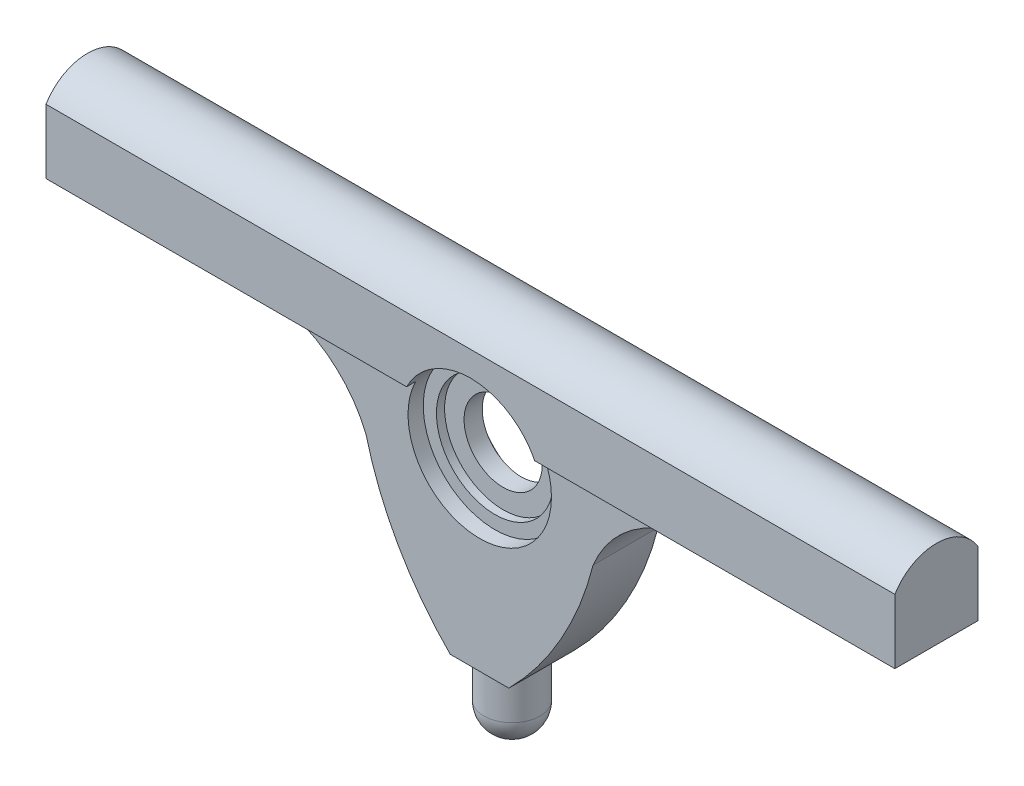
ISO-10303-21;
HEADER;
FILE_DESCRIPTION(('STEP AP214'),'2;1');
FILE_NAME('part.step','',(''),(''),'','','');
FILE_SCHEMA(('AUTOMOTIVE_DESIGN { 1 0 10303 214 1 1 1 1 }'));
ENDSEC;
DATA;
#1=APPLICATION_CONTEXT('core data for automotive mechanical design processes');
#2=APPLICATION_PROTOCOL_DEFINITION('international standard','automotive_design',2000,#1);
#3=PRODUCT_CONTEXT('',#1,'mechanical');
#4=PRODUCT('Part','Part','',(#3));
#5=PRODUCT_RELATED_PRODUCT_CATEGORY('part','',(#4));
#6=PRODUCT_DEFINITION_FORMATION('','',#4);
#7=PRODUCT_DEFINITION_CONTEXT('part definition',#1,'design');
#8=PRODUCT_DEFINITION('design','',#6,#7);
#9=PRODUCT_DEFINITION_SHAPE('','',#8);
#10=(LENGTH_UNIT() NAMED_UNIT(*) SI_UNIT(.MILLI.,.METRE.));
#11=(NAMED_UNIT(*) PLANE_ANGLE_UNIT() SI_UNIT($,.RADIAN.));
#12=(NAMED_UNIT(*) SI_UNIT($,.STERADIAN.) SOLID_ANGLE_UNIT());
#13=UNCERTAINTY_MEASURE_WITH_UNIT(LENGTH_MEASURE(1.E-05),#10,'distance_accuracy_value','');
#14=(GEOMETRIC_REPRESENTATION_CONTEXT(3) GLOBAL_UNCERTAINTY_ASSIGNED_CONTEXT((#13)) GLOBAL_UNIT_ASSIGNED_CONTEXT((#10,
#11,#12)) REPRESENTATION_CONTEXT('',''));
#15=CARTESIAN_POINT('',(0.,0.,0.));
#16=DIRECTION('',(0.,0.,1.));
#17=DIRECTION('',(1.,0.,0.));
#18=AXIS2_PLACEMENT_3D('',#15,#16,#17);
#19=CARTESIAN_POINT('',(92.075,-6.985,9.017));
#20=DIRECTION('',(0.,1.,0.));
#21=DIRECTION('',(0.,0.,1.));
#22=AXIS2_PLACEMENT_3D('',#19,#20,#21);
#23=PLANE('',#22);
#24=DIRECTION('',(0.,0.,1.));
#25=VECTOR('',#24,1.);
#26=CARTESIAN_POINT('',(-13.8470055256227,-6.985,55.7699492853136));
#27=LINE('',#26,#25);
#28=CARTESIAN_POINT('',(-13.8470055256227,-6.985,9.017));
#29=VERTEX_POINT('',#28);
#30=CARTESIAN_POINT('',(-13.8470055256227,-6.985,7.04850000000001));
#31=VERTEX_POINT('',#30);
#32=EDGE_CURVE('E49',#29,#31,#27,.F.);
#33=ORIENTED_EDGE('',*,*,#32,.F.);
#34=DIRECTION('',(-1.,0.,0.));
#35=VECTOR('',#34,1.);
#36=CARTESIAN_POINT('',(92.075,-6.985,9.017));
#37=LINE('',#36,#35);
#38=CARTESIAN_POINT('',(-92.075,-6.985,9.017));
#39=VERTEX_POINT('',#38);
#40=EDGE_CURVE('E156',#29,#39,#37,.T.);
#41=ORIENTED_EDGE('',*,*,#40,.T.);
#42=DIRECTION('',(0.,0.,-1.));
#43=VECTOR('',#42,1.);
#44=CARTESIAN_POINT('',(-92.075,-6.985,9.017));
#45=LINE('',#44,#43);
#46=CARTESIAN_POINT('',(-92.075,-6.985,-9.017));
#47=VERTEX_POINT('',#46);
#48=EDGE_CURVE('E347',#39,#47,#45,.T.);
#49=ORIENTED_EDGE('',*,*,#48,.T.);
#50=DIRECTION('',(-1.,0.,0.));
#51=VECTOR('',#50,1.);
#52=CARTESIAN_POINT('',(92.075,-6.985,-9.017));
#53=LINE('',#52,#51);
#54=CARTESIAN_POINT('',(-13.8470055256227,-6.985,-9.017));
#55=VERTEX_POINT('',#54);
#56=EDGE_CURVE('E157',#55,#47,#53,.T.);
#57=ORIENTED_EDGE('',*,*,#56,.F.);
#58=DIRECTION('',(0.,0.,1.));
#59=VECTOR('',#58,1.);
#60=CARTESIAN_POINT('',(-13.8470055256227,-6.985,55.7699492853136));
#61=LINE('',#60,#59);
#62=CARTESIAN_POINT('',(-13.8470055256227,-6.985,-7.04849999999999));
#63=VERTEX_POINT('',#62);
#64=EDGE_CURVE('E135',#63,#55,#61,.F.);
#65=ORIENTED_EDGE('',*,*,#64,.F.);
#66=DIRECTION('',(-1.,0.,0.));
#67=VECTOR('',#66,1.);
#68=CARTESIAN_POINT('',(-43.18,-6.985,-7.0485));
#69=LINE('',#68,#67);
#70=CARTESIAN_POINT('',(-43.18,-6.985,-7.0485));
#71=VERTEX_POINT('',#70);
#72=EDGE_CURVE('E169',#63,#71,#69,.T.);
#73=ORIENTED_EDGE('',*,*,#72,.T.);
#74=DIRECTION('',(0.,0.,1.));
#75=VECTOR('',#74,1.);
#76=CARTESIAN_POINT('',(-43.18,-6.985,-7.0485));
#77=LINE('',#76,#75);
#78=CARTESIAN_POINT('',(-43.18,-6.985,7.0485));
#79=VERTEX_POINT('',#78);
#80=EDGE_CURVE('E184',#71,#79,#77,.T.);
#81=ORIENTED_EDGE('',*,*,#80,.T.);
#82=DIRECTION('',(-1.,0.,0.));
#83=VECTOR('',#82,1.);
#84=CARTESIAN_POINT('',(-43.18,-6.985,7.0485));
#85=LINE('',#84,#83);
#86=EDGE_CURVE('E181',#31,#79,#85,.T.);
#87=ORIENTED_EDGE('',*,*,#86,.F.);
#88=EDGE_LOOP('',(#33,#41,#49,#57,#65,#73,#81,#87));
#89=FACE_BOUND('',#88,.T.);
#90=ADVANCED_FACE('F34',(#89),#23,.F.);
#91=DIRECTION('',(0.,0.,1.));
#92=VECTOR('',#91,1.);
#93=CARTESIAN_POINT('',(13.9482534524388,-6.985,55.7699492853136));
#94=LINE('',#93,#92);
#95=CARTESIAN_POINT('',(13.9482534524388,-6.985,7.04850000000001));
#96=VERTEX_POINT('',#95);
#97=CARTESIAN_POINT('',(13.9482534524388,-6.985,9.017));
#98=VERTEX_POINT('',#97);
#99=EDGE_CURVE('E270',#96,#98,#94,.T.);
#100=ORIENTED_EDGE('',*,*,#99,.F.);
#101=CARTESIAN_POINT('',(43.18,-6.985,7.0485));
#102=VERTEX_POINT('',#101);
#103=EDGE_CURVE('E177',#102,#96,#85,.T.);
#104=ORIENTED_EDGE('',*,*,#103,.F.);
#105=DIRECTION('',(0.,0.,1.));
#106=VECTOR('',#105,1.);
#107=CARTESIAN_POINT('',(43.18,-6.985,-7.0485));
#108=LINE('',#107,#106);
#109=CARTESIAN_POINT('',(43.18,-6.985,-7.0485));
#110=VERTEX_POINT('',#109);
#111=EDGE_CURVE('E172',#110,#102,#108,.T.);
#112=ORIENTED_EDGE('',*,*,#111,.F.);
#113=CARTESIAN_POINT('',(13.9482534524388,-6.985,-7.04849999999999));
#114=VERTEX_POINT('',#113);
#115=EDGE_CURVE('E150',#110,#114,#69,.T.);
#116=ORIENTED_EDGE('',*,*,#115,.T.);
#117=DIRECTION('',(0.,0.,1.));
#118=VECTOR('',#117,1.);
#119=CARTESIAN_POINT('',(13.9482534524388,-6.985,55.7699492853136));
#120=LINE('',#119,#118);
#121=CARTESIAN_POINT('',(13.9482534524388,-6.985,-9.017));
#122=VERTEX_POINT('',#121);
#123=EDGE_CURVE('E56',#122,#114,#120,.T.);
#124=ORIENTED_EDGE('',*,*,#123,.F.);
#125=CARTESIAN_POINT('',(92.075,-6.985,-9.017));
#126=VERTEX_POINT('',#125);
#127=EDGE_CURVE('E147',#126,#122,#53,.T.);
#128=ORIENTED_EDGE('',*,*,#127,.F.);
#129=DIRECTION('',(0.,0.,-1.));
#130=VECTOR('',#129,1.);
#131=CARTESIAN_POINT('',(92.075,-6.985,9.017));
#132=LINE('',#131,#130);
#133=CARTESIAN_POINT('',(92.075,-6.985,9.017));
#134=VERTEX_POINT('',#133);
#135=EDGE_CURVE('E334',#134,#126,#132,.T.);
#136=ORIENTED_EDGE('',*,*,#135,.F.);
#137=EDGE_CURVE('E159',#134,#98,#37,.T.);
#138=ORIENTED_EDGE('',*,*,#137,.T.);
#139=EDGE_LOOP('',(#100,#104,#112,#116,#124,#128,#136,#138));
#140=FACE_BOUND('',#139,.T.);
#141=ADVANCED_FACE('F145',(#140),#23,.F.);
#142=CARTESIAN_POINT('',(92.075,1.5224125,0.));
#143=DIRECTION('',(-1.,0.,0.));
#144=DIRECTION('',(0.,0.,1.));
#145=AXIS2_PLACEMENT_3D('',#142,#143,#144);
#146=CYLINDRICAL_SURFACE('',#145,10.5425875);
#147=CARTESIAN_POINT('',(-92.075,1.5224125,0.));
#148=DIRECTION('',(1.,0.,0.));
#149=DIRECTION('',(0.,0.,1.));
#150=AXIS2_PLACEMENT_3D('',#147,#148,#149);
#151=CIRCLE('',#150,10.5425875);
#152=CARTESIAN_POINT('',(-92.075,6.985,-9.017));
#153=VERTEX_POINT('',#152);
#154=CARTESIAN_POINT('',(-92.075,6.985,9.017));
#155=VERTEX_POINT('',#154);
#156=EDGE_CURVE('E210',#153,#155,#151,.T.);
#157=ORIENTED_EDGE('',*,*,#156,.T.);
#158=DIRECTION('',(-1.,0.,0.));
#159=VECTOR('',#158,1.);
#160=CARTESIAN_POINT('',(92.075,6.985,9.017));
#161=LINE('',#160,#159);
#162=CARTESIAN_POINT('',(92.075,6.985,9.017));
#163=VERTEX_POINT('',#162);
#164=EDGE_CURVE('E166',#163,#155,#161,.T.);
#165=ORIENTED_EDGE('',*,*,#164,.F.);
#166=CARTESIAN_POINT('',(92.075,1.5224125,0.));
#167=DIRECTION('',(1.,0.,0.));
#168=DIRECTION('',(0.,0.,1.));
#169=AXIS2_PLACEMENT_3D('',#166,#167,#168);
#170=CIRCLE('',#169,10.5425875);
#171=CARTESIAN_POINT('',(92.075,6.985,-9.017));
#172=VERTEX_POINT('',#171);
#173=EDGE_CURVE('E339',#172,#163,#170,.T.);
#174=ORIENTED_EDGE('',*,*,#173,.F.);
#175=DIRECTION('',(-1.,0.,0.));
#176=VECTOR('',#175,1.);
#177=CARTESIAN_POINT('',(92.075,6.985,-9.017));
#178=LINE('',#177,#176);
#179=EDGE_CURVE('E161',#172,#153,#178,.T.);
#180=ORIENTED_EDGE('',*,*,#179,.T.);
#181=EDGE_LOOP('',(#157,#165,#174,#180));
#182=FACE_BOUND('',#181,.T.);
#183=ADVANCED_FACE('F36',(#182),#146,.T.);
#184=CARTESIAN_POINT('',(92.075,-6.985,9.017));
#185=DIRECTION('',(0.,0.,-1.));
#186=DIRECTION('',(-1.,0.,0.));
#187=AXIS2_PLACEMENT_3D('',#184,#185,#186);
#188=PLANE('',#187);
#189=CARTESIAN_POINT('',(0.0506239634080682,-13.9772600663607,9.017));
#190=DIRECTION('',(0.,0.,1.));
#191=DIRECTION('',(1.,0.,0.));
#192=AXIS2_PLACEMENT_3D('',#189,#190,#191);
#193=CIRCLE('',#192,15.5575);
#194=EDGE_CURVE('E151',#98,#29,#193,.T.);
#195=ORIENTED_EDGE('',*,*,#194,.F.);
#196=ORIENTED_EDGE('',*,*,#137,.F.);
#197=DIRECTION('',(0.,-1.,0.));
#198=VECTOR('',#197,1.);
#199=CARTESIAN_POINT('',(92.075,-6.985,9.017));
#200=LINE('',#199,#198);
#201=EDGE_CURVE('E336',#163,#134,#200,.T.);
#202=ORIENTED_EDGE('',*,*,#201,.F.);
#203=ORIENTED_EDGE('',*,*,#164,.T.);
#204=DIRECTION('',(0.,-1.,0.));
#205=VECTOR('',#204,1.);
#206=CARTESIAN_POINT('',(-92.075,-6.985,9.017));
#207=LINE('',#206,#205);
#208=EDGE_CURVE('E345',#155,#39,#207,.T.);
#209=ORIENTED_EDGE('',*,*,#208,.T.);
#210=ORIENTED_EDGE('',*,*,#40,.F.);
#211=EDGE_LOOP('',(#195,#196,#202,#203,#209,#210));
#212=FACE_BOUND('',#211,.T.);
#213=ADVANCED_FACE('F320',(#212),#188,.F.);
#214=CARTESIAN_POINT('',(92.075,-6.985,-9.017));
#215=DIRECTION('',(0.,0.,1.));
#216=DIRECTION('',(1.,0.,0.));
#217=AXIS2_PLACEMENT_3D('',#214,#215,#216);
#218=PLANE('',#217);
#219=CARTESIAN_POINT('',(0.0506239634080682,-13.9772600663607,-9.017));
#220=DIRECTION('',(0.,0.,1.));
#221=DIRECTION('',(1.,0.,0.));
#222=AXIS2_PLACEMENT_3D('',#219,#220,#221);
#223=CIRCLE('',#222,15.5575);
#224=EDGE_CURVE('E132',#122,#55,#223,.T.);
#225=ORIENTED_EDGE('',*,*,#224,.T.);
#226=ORIENTED_EDGE('',*,*,#56,.T.);
#227=DIRECTION('',(0.,1.,0.));
#228=VECTOR('',#227,1.);
#229=CARTESIAN_POINT('',(-92.075,-6.985,-9.017));
#230=LINE('',#229,#228);
#231=EDGE_CURVE('E348',#47,#153,#230,.T.);
#232=ORIENTED_EDGE('',*,*,#231,.T.);
#233=ORIENTED_EDGE('',*,*,#179,.F.);
#234=DIRECTION('',(0.,1.,0.));
#235=VECTOR('',#234,1.);
#236=CARTESIAN_POINT('',(92.075,-6.985,-9.017));
#237=LINE('',#236,#235);
#238=EDGE_CURVE('E155',#126,#172,#237,.T.);
#239=ORIENTED_EDGE('',*,*,#238,.F.);
#240=ORIENTED_EDGE('',*,*,#127,.T.);
#241=EDGE_LOOP('',(#225,#226,#232,#233,#239,#240));
#242=FACE_BOUND('',#241,.T.);
#243=ADVANCED_FACE('F153',(#242),#218,.F.);
#244=CARTESIAN_POINT('',(92.075,1.5224125,0.));
#245=DIRECTION('',(-1.,0.,0.));
#246=DIRECTION('',(0.,0.,1.));
#247=AXIS2_PLACEMENT_3D('',#244,#245,#246);
#248=PLANE('',#247);
#249=ORIENTED_EDGE('',*,*,#173,.T.);
#250=ORIENTED_EDGE('',*,*,#201,.T.);
#251=ORIENTED_EDGE('',*,*,#135,.T.);
#252=ORIENTED_EDGE('',*,*,#238,.T.);
#253=EDGE_LOOP('',(#249,#250,#251,#252));
#254=FACE_BOUND('',#253,.T.);
#255=ADVANCED_FACE('F327',(#254),#248,.F.);
#256=CARTESIAN_POINT('',(-92.075,1.5224125,0.));
#257=DIRECTION('',(-1.,0.,0.));
#258=DIRECTION('',(0.,0.,1.));
#259=AXIS2_PLACEMENT_3D('',#256,#257,#258);
#260=PLANE('',#259);
#261=ORIENTED_EDGE('',*,*,#156,.F.);
#262=ORIENTED_EDGE('',*,*,#231,.F.);
#263=ORIENTED_EDGE('',*,*,#48,.F.);
#264=ORIENTED_EDGE('',*,*,#208,.F.);
#265=EDGE_LOOP('',(#261,#262,#263,#264));
#266=FACE_BOUND('',#265,.T.);
#267=ADVANCED_FACE('F358',(#266),#260,.T.);
#268=CARTESIAN_POINT('',(0.,0.,7.04850000000001));
#269=DIRECTION('',(0.,0.,1.));
#270=DIRECTION('',(1.,0.,0.));
#271=AXIS2_PLACEMENT_3D('',#268,#269,#270);
#272=PLANE('',#271);
#273=ORIENTED_EDGE('',*,*,#103,.T.);
#274=CARTESIAN_POINT('',(0.0506239634080682,-13.9772600663607,7.04850000000001));
#275=DIRECTION('',(0.,0.,1.));
#276=DIRECTION('',(1.,0.,0.));
#277=AXIS2_PLACEMENT_3D('',#274,#275,#276);
#278=CIRCLE('',#277,15.5575);
#279=EDGE_CURVE('E12',#96,#31,#278,.F.);
#280=ORIENTED_EDGE('',*,*,#279,.T.);
#281=ORIENTED_EDGE('',*,*,#86,.T.);
#282=CARTESIAN_POINT('',(-48.1234864990168,-31.8992919071371,7.0485));
#283=DIRECTION('',(0.,0.,-1.));
#284=DIRECTION('',(-1.,0.,0.));
#285=AXIS2_PLACEMENT_3D('',#282,#283,#284);
#286=CIRCLE('',#285,25.4);
#287=CARTESIAN_POINT('',(-24.638,-22.225,7.0485));
#288=VERTEX_POINT('',#287);
#289=EDGE_CURVE('E225',#79,#288,#286,.T.);
#290=ORIENTED_EDGE('',*,*,#289,.T.);
#291=CARTESIAN_POINT('',(43.09050551181,-5.14073703267465,7.0485));
#292=DIRECTION('',(0.,0.,1.));
#293=DIRECTION('',(1.,0.,0.));
#294=AXIS2_PLACEMENT_3D('',#291,#292,#293);
#295=CIRCLE('',#294,69.85);
#296=CARTESIAN_POINT('',(-6.35,-54.483,7.0485));
#297=VERTEX_POINT('',#296);
#298=EDGE_CURVE('E211',#288,#297,#295,.T.);
#299=ORIENTED_EDGE('',*,*,#298,.T.);
#300=DIRECTION('',(1.,0.,0.));
#301=VECTOR('',#300,1.);
#302=CARTESIAN_POINT('',(6.35,-54.483,7.0485));
#303=LINE('',#302,#301);
#304=CARTESIAN_POINT('',(6.35,-54.483,7.0485));
#305=VERTEX_POINT('',#304);
#306=EDGE_CURVE('E218',#297,#305,#303,.T.);
#307=ORIENTED_EDGE('',*,*,#306,.T.);
#308=CARTESIAN_POINT('',(-43.09050551181,-5.14073703267465,7.0485));
#309=DIRECTION('',(0.,0.,1.));
#310=DIRECTION('',(-1.,0.,0.));
#311=AXIS2_PLACEMENT_3D('',#308,#309,#310);
#312=CIRCLE('',#311,69.85);
#313=CARTESIAN_POINT('',(24.638,-22.225,7.0485));
#314=VERTEX_POINT('',#313);
#315=EDGE_CURVE('E239',#305,#314,#312,.T.);
#316=ORIENTED_EDGE('',*,*,#315,.T.);
#317=CARTESIAN_POINT('',(48.1234864990168,-31.8992919071371,7.0485));
#318=DIRECTION('',(0.,0.,-1.));
#319=DIRECTION('',(1.,0.,0.));
#320=AXIS2_PLACEMENT_3D('',#317,#318,#319);
#321=CIRCLE('',#320,25.4);
#322=EDGE_CURVE('E253',#314,#102,#321,.T.);
#323=ORIENTED_EDGE('',*,*,#322,.T.);
#324=EDGE_LOOP('',(#273,#280,#281,#290,#299,#307,#316,#323));
#325=FACE_BOUND('',#324,.T.);
#326=ADVANCED_FACE('F271',(#325),#272,.T.);
#327=CARTESIAN_POINT('',(0.,0.,-7.04849999999999));
#328=DIRECTION('',(0.,0.,1.));
#329=DIRECTION('',(1.,0.,0.));
#330=AXIS2_PLACEMENT_3D('',#327,#328,#329);
#331=PLANE('',#330);
#332=CARTESIAN_POINT('',(0.0506239634080682,-13.9772600663607,-7.04849999999999));
#333=DIRECTION('',(0.,0.,1.));
#334=DIRECTION('',(1.,0.,0.));
#335=AXIS2_PLACEMENT_3D('',#332,#333,#334);
#336=CIRCLE('',#335,15.5575);
#337=EDGE_CURVE('E42',#114,#63,#336,.F.);
#338=ORIENTED_EDGE('',*,*,#337,.F.);
#339=ORIENTED_EDGE('',*,*,#115,.F.);
#340=CARTESIAN_POINT('',(48.1234864990168,-31.8992919071371,-7.0485));
#341=DIRECTION('',(0.,0.,-1.));
#342=DIRECTION('',(1.,0.,0.));
#343=AXIS2_PLACEMENT_3D('',#340,#341,#342);
#344=CIRCLE('',#343,25.4);
#345=CARTESIAN_POINT('',(24.638,-22.225,-7.0485));
#346=VERTEX_POINT('',#345);
#347=EDGE_CURVE('E247',#346,#110,#344,.T.);
#348=ORIENTED_EDGE('',*,*,#347,.F.);
#349=CARTESIAN_POINT('',(-43.09050551181,-5.14073703267465,-7.0485));
#350=DIRECTION('',(0.,0.,1.));
#351=DIRECTION('',(-1.,0.,0.));
#352=AXIS2_PLACEMENT_3D('',#349,#350,#351);
#353=CIRCLE('',#352,69.85);
#354=CARTESIAN_POINT('',(6.35,-54.483,-7.0485));
#355=VERTEX_POINT('',#354);
#356=EDGE_CURVE('E233',#355,#346,#353,.T.);
#357=ORIENTED_EDGE('',*,*,#356,.F.);
#358=DIRECTION('',(1.,0.,0.));
#359=VECTOR('',#358,1.);
#360=CARTESIAN_POINT('',(6.35,-54.483,-7.0485));
#361=LINE('',#360,#359);
#362=CARTESIAN_POINT('',(-6.35,-54.483,-7.0485));
#363=VERTEX_POINT('',#362);
#364=EDGE_CURVE('E217',#363,#355,#361,.T.);
#365=ORIENTED_EDGE('',*,*,#364,.F.);
#366=CARTESIAN_POINT('',(43.09050551181,-5.14073703267465,-7.0485));
#367=DIRECTION('',(0.,0.,1.));
#368=DIRECTION('',(1.,0.,0.));
#369=AXIS2_PLACEMENT_3D('',#366,#367,#368);
#370=CIRCLE('',#369,69.85);
#371=CARTESIAN_POINT('',(-24.638,-22.225,-7.0485));
#372=VERTEX_POINT('',#371);
#373=EDGE_CURVE('E207',#372,#363,#370,.T.);
#374=ORIENTED_EDGE('',*,*,#373,.F.);
#375=CARTESIAN_POINT('',(-48.1234864990168,-31.8992919071371,-7.0485));
#376=DIRECTION('',(0.,0.,-1.));
#377=DIRECTION('',(-1.,0.,0.));
#378=AXIS2_PLACEMENT_3D('',#375,#376,#377);
#379=CIRCLE('',#378,25.4);
#380=EDGE_CURVE('E192',#71,#372,#379,.T.);
#381=ORIENTED_EDGE('',*,*,#380,.F.);
#382=ORIENTED_EDGE('',*,*,#72,.F.);
#383=EDGE_LOOP('',(#338,#339,#348,#357,#365,#374,#381,#382));
#384=FACE_BOUND('',#383,.T.);
#385=ADVANCED_FACE('F278',(#384),#331,.F.);
#386=CARTESIAN_POINT('',(-48.1234864990168,-31.8992919071371,-7.0485));
#387=DIRECTION('',(0.,0.,1.));
#388=DIRECTION('',(1.,0.,0.));
#389=AXIS2_PLACEMENT_3D('',#386,#387,#388);
#390=CYLINDRICAL_SURFACE('',#389,25.4);
#391=ORIENTED_EDGE('',*,*,#289,.F.);
#392=ORIENTED_EDGE('',*,*,#80,.F.);
#393=ORIENTED_EDGE('',*,*,#380,.T.);
#394=DIRECTION('',(0.,0.,1.));
#395=VECTOR('',#394,1.);
#396=CARTESIAN_POINT('',(-24.638,-22.225,-7.0485));
#397=LINE('',#396,#395);
#398=EDGE_CURVE('E187',#372,#288,#397,.T.);
#399=ORIENTED_EDGE('',*,*,#398,.T.);
#400=EDGE_LOOP('',(#391,#392,#393,#399));
#401=FACE_BOUND('',#400,.T.);
#402=ADVANCED_FACE('F360',(#401),#390,.F.);
#403=CARTESIAN_POINT('',(48.1234864990168,-31.8992919071371,-7.0485));
#404=DIRECTION('',(0.,0.,1.));
#405=DIRECTION('',(1.,0.,0.));
#406=AXIS2_PLACEMENT_3D('',#403,#404,#405);
#407=CYLINDRICAL_SURFACE('',#406,25.4);
#408=ORIENTED_EDGE('',*,*,#322,.F.);
#409=DIRECTION('',(0.,0.,1.));
#410=VECTOR('',#409,1.);
#411=CARTESIAN_POINT('',(24.638,-22.225,-7.0485));
#412=LINE('',#411,#410);
#413=EDGE_CURVE('E250',#346,#314,#412,.T.);
#414=ORIENTED_EDGE('',*,*,#413,.F.);
#415=ORIENTED_EDGE('',*,*,#347,.T.);
#416=ORIENTED_EDGE('',*,*,#111,.T.);
#417=EDGE_LOOP('',(#408,#414,#415,#416));
#418=FACE_BOUND('',#417,.T.);
#419=ADVANCED_FACE('F268',(#418),#407,.F.);
#420=CARTESIAN_POINT('',(-43.09050551181,-5.14073703267465,-7.0485));
#421=DIRECTION('',(0.,0.,1.));
#422=DIRECTION('',(1.,0.,0.));
#423=AXIS2_PLACEMENT_3D('',#420,#421,#422);
#424=CYLINDRICAL_SURFACE('',#423,69.85);
#425=ORIENTED_EDGE('',*,*,#315,.F.);
#426=DIRECTION('',(0.,0.,1.));
#427=VECTOR('',#426,1.);
#428=CARTESIAN_POINT('',(6.35,-54.483,-7.0485));
#429=LINE('',#428,#427);
#430=EDGE_CURVE('E236',#355,#305,#429,.T.);
#431=ORIENTED_EDGE('',*,*,#430,.F.);
#432=ORIENTED_EDGE('',*,*,#356,.T.);
#433=ORIENTED_EDGE('',*,*,#413,.T.);
#434=EDGE_LOOP('',(#425,#431,#432,#433));
#435=FACE_BOUND('',#434,.T.);
#436=ADVANCED_FACE('F276',(#435),#424,.T.);
#437=CARTESIAN_POINT('',(6.35,-54.483,-7.0485));
#438=DIRECTION('',(0.,-1.,0.));
#439=DIRECTION('',(0.,0.,-1.));
#440=AXIS2_PLACEMENT_3D('',#437,#438,#439);
#441=PLANE('',#440);
#442=CARTESIAN_POINT('',(0.,-54.483,0.));
#443=DIRECTION('',(0.,1.,0.));
#444=DIRECTION('',(-1.,0.,0.));
#445=AXIS2_PLACEMENT_3D('',#442,#443,#444);
#446=CIRCLE('',#445,6.096);
#447=CARTESIAN_POINT('',(-6.096,-54.483,0.));
#448=VERTEX_POINT('',#447);
#449=EDGE_CURVE('E201',#448,#448,#446,.T.);
#450=ORIENTED_EDGE('',*,*,#449,.T.);
#451=EDGE_LOOP('',(#450));
#452=FACE_BOUND('',#451,.T.);
#453=ORIENTED_EDGE('',*,*,#306,.F.);
#454=DIRECTION('',(0.,0.,1.));
#455=VECTOR('',#454,1.);
#456=CARTESIAN_POINT('',(-6.35,-54.483,-7.0485));
#457=LINE('',#456,#455);
#458=EDGE_CURVE('E214',#363,#297,#457,.T.);
#459=ORIENTED_EDGE('',*,*,#458,.F.);
#460=ORIENTED_EDGE('',*,*,#364,.T.);
#461=ORIENTED_EDGE('',*,*,#430,.T.);
#462=EDGE_LOOP('',(#453,#459,#460,#461));
#463=FACE_BOUND('',#462,.T.);
#464=ADVANCED_FACE('F296',(#452,#463),#441,.T.);
#465=CARTESIAN_POINT('',(43.09050551181,-5.14073703267465,-7.0485));
#466=DIRECTION('',(0.,0.,1.));
#467=DIRECTION('',(1.,0.,0.));
#468=AXIS2_PLACEMENT_3D('',#465,#466,#467);
#469=CYLINDRICAL_SURFACE('',#468,69.85);
#470=ORIENTED_EDGE('',*,*,#298,.F.);
#471=ORIENTED_EDGE('',*,*,#398,.F.);
#472=ORIENTED_EDGE('',*,*,#373,.T.);
#473=ORIENTED_EDGE('',*,*,#458,.T.);
#474=EDGE_LOOP('',(#470,#471,#472,#473));
#475=FACE_BOUND('',#474,.T.);
#476=ADVANCED_FACE('F310',(#475),#469,.T.);
#477=CARTESIAN_POINT('',(0.,-63.373,0.));
#478=DIRECTION('',(0.,1.,0.));
#479=DIRECTION('',(1.,0.,0.));
#480=AXIS2_PLACEMENT_3D('',#477,#478,#479);
#481=SPHERICAL_SURFACE('',#480,6.096);
#482=CARTESIAN_POINT('',(0.,-63.373,0.));
#483=DIRECTION('',(0.,1.,0.));
#484=DIRECTION('',(-1.,0.,0.));
#485=AXIS2_PLACEMENT_3D('',#482,#483,#484);
#486=CIRCLE('',#485,6.096);
#487=CARTESIAN_POINT('',(-6.096,-63.373,0.));
#488=VERTEX_POINT('',#487);
#489=EDGE_CURVE('E289',#488,#488,#486,.T.);
#490=ORIENTED_EDGE('',*,*,#489,.F.);
#491=EDGE_LOOP('',(#490));
#492=FACE_BOUND('',#491,.T.);
#493=ADVANCED_FACE('F302',(#492),#481,.T.);
#494=CARTESIAN_POINT('',(0.,-47.1341988320855,0.));
#495=DIRECTION('',(0.,1.,0.));
#496=DIRECTION('',(-1.,0.,0.));
#497=AXIS2_PLACEMENT_3D('',#494,#495,#496);
#498=CYLINDRICAL_SURFACE('',#497,6.096);
#499=ORIENTED_EDGE('',*,*,#449,.F.);
#500=EDGE_LOOP('',(#499));
#501=FACE_BOUND('',#500,.T.);
#502=ORIENTED_EDGE('',*,*,#489,.T.);
#503=EDGE_LOOP('',(#502));
#504=FACE_BOUND('',#503,.T.);
#505=ADVANCED_FACE('F299',(#501,#504),#498,.T.);
#506=CARTESIAN_POINT('',(0.0506239634080682,-13.9772600663607,55.7699492853136));
#507=DIRECTION('',(0.,0.,1.));
#508=DIRECTION('',(1.,0.,0.));
#509=AXIS2_PLACEMENT_3D('',#506,#507,#508);
#510=CYLINDRICAL_SURFACE('',#509,15.5575);
#511=CARTESIAN_POINT('',(0.0506239634080682,-13.9772600663607,3.7465));
#512=DIRECTION('',(0.,0.,1.));
#513=DIRECTION('',(1.,0.,0.));
#514=AXIS2_PLACEMENT_3D('',#511,#512,#513);
#515=CIRCLE('',#514,15.5575);
#516=CARTESIAN_POINT('',(15.6081239634081,-13.9772600663607,3.7465));
#517=VERTEX_POINT('',#516);
#518=EDGE_CURVE('E333',#517,#517,#515,.T.);
#519=ORIENTED_EDGE('',*,*,#518,.F.);
#520=EDGE_LOOP('',(#519));
#521=FACE_BOUND('',#520,.T.);
#522=ORIENTED_EDGE('',*,*,#32,.T.);
#523=ORIENTED_EDGE('',*,*,#279,.F.);
#524=ORIENTED_EDGE('',*,*,#99,.T.);
#525=ORIENTED_EDGE('',*,*,#194,.T.);
#526=EDGE_LOOP('',(#522,#523,#524,#525));
#527=FACE_BOUND('',#526,.T.);
#528=ADVANCED_FACE('F301',(#521,#527),#510,.F.);
#529=CARTESIAN_POINT('',(0.0506239634080682,-13.9772600663607,55.7699492853136));
#530=DIRECTION('',(0.,0.,1.));
#531=DIRECTION('',(1.,0.,0.));
#532=AXIS2_PLACEMENT_3D('',#529,#530,#531);
#533=CYLINDRICAL_SURFACE('',#532,15.5575);
#534=CARTESIAN_POINT('',(0.0506239634080682,-13.9772600663607,-3.7465));
#535=DIRECTION('',(0.,0.,1.));
#536=DIRECTION('',(1.,0.,0.));
#537=AXIS2_PLACEMENT_3D('',#534,#535,#536);
#538=CIRCLE('',#537,15.5575);
#539=CARTESIAN_POINT('',(15.6081239634081,-13.9772600663607,-3.7465));
#540=VERTEX_POINT('',#539);
#541=EDGE_CURVE('E139',#540,#540,#538,.T.);
#542=ORIENTED_EDGE('',*,*,#541,.T.);
#543=EDGE_LOOP('',(#542));
#544=FACE_BOUND('',#543,.T.);
#545=ORIENTED_EDGE('',*,*,#64,.T.);
#546=ORIENTED_EDGE('',*,*,#224,.F.);
#547=ORIENTED_EDGE('',*,*,#123,.T.);
#548=ORIENTED_EDGE('',*,*,#337,.T.);
#549=EDGE_LOOP('',(#545,#546,#547,#548));
#550=FACE_BOUND('',#549,.T.);
#551=ADVANCED_FACE('F133',(#544,#550),#533,.F.);
#552=CARTESIAN_POINT('',(15.6081239634081,-13.9772600663607,3.7465));
#553=DIRECTION('',(0.,0.,1.));
#554=DIRECTION('',(1.,0.,0.));
#555=AXIS2_PLACEMENT_3D('',#552,#553,#554);
#556=PLANE('',#555);
#557=ORIENTED_EDGE('',*,*,#518,.T.);
#558=EDGE_LOOP('',(#557));
#559=FACE_BOUND('',#558,.T.);
#560=CARTESIAN_POINT('',(0.0506239634080682,-13.9772600663607,3.7465));
#561=DIRECTION('',(0.,0.,1.));
#562=DIRECTION('',(1.,0.,0.));
#563=AXIS2_PLACEMENT_3D('',#560,#561,#562);
#564=CIRCLE('',#563,12.7);
#565=CARTESIAN_POINT('',(12.7506239634081,-13.9772600663607,3.7465));
#566=VERTEX_POINT('',#565);
#567=EDGE_CURVE('E575',#566,#566,#564,.T.);
#568=ORIENTED_EDGE('',*,*,#567,.F.);
#569=EDGE_LOOP('',(#568));
#570=FACE_BOUND('',#569,.T.);
#571=ADVANCED_FACE('F480',(#559,#570),#556,.T.);
#572=CARTESIAN_POINT('',(0.0506239634080682,-13.9772600663607,55.7699492853136));
#573=DIRECTION('',(0.,0.,1.));
#574=DIRECTION('',(1.,0.,0.));
#575=AXIS2_PLACEMENT_3D('',#572,#573,#574);
#576=CYLINDRICAL_SURFACE('',#575,12.7);
#577=ORIENTED_EDGE('',*,*,#567,.T.);
#578=EDGE_LOOP('',(#577));
#579=FACE_BOUND('',#578,.T.);
#580=CARTESIAN_POINT('',(0.0506239634080682,-13.9772600663607,1.9685));
#581=DIRECTION('',(0.,0.,1.));
#582=DIRECTION('',(1.,0.,0.));
#583=AXIS2_PLACEMENT_3D('',#580,#581,#582);
#584=CIRCLE('',#583,12.7);
#585=CARTESIAN_POINT('',(12.7506239634081,-13.9772600663607,1.9685));
#586=VERTEX_POINT('',#585);
#587=EDGE_CURVE('E572',#586,#586,#584,.T.);
#588=ORIENTED_EDGE('',*,*,#587,.F.);
#589=EDGE_LOOP('',(#588));
#590=FACE_BOUND('',#589,.T.);
#591=ADVANCED_FACE('F489',(#579,#590),#576,.F.);
#592=CARTESIAN_POINT('',(12.7506239634081,-13.9772600663607,1.9685));
#593=DIRECTION('',(0.,0.,1.));
#594=DIRECTION('',(1.,0.,0.));
#595=AXIS2_PLACEMENT_3D('',#592,#593,#594);
#596=PLANE('',#595);
#597=ORIENTED_EDGE('',*,*,#587,.T.);
#598=EDGE_LOOP('',(#597));
#599=FACE_BOUND('',#598,.T.);
#600=CARTESIAN_POINT('',(0.0506239634080682,-13.9772600663607,1.9685));
#601=DIRECTION('',(0.,0.,1.));
#602=DIRECTION('',(1.,0.,0.));
#603=AXIS2_PLACEMENT_3D('',#600,#601,#602);
#604=CIRCLE('',#603,8.4836);
#605=CARTESIAN_POINT('',(8.53422396340807,-13.9772600663607,1.9685));
#606=VERTEX_POINT('',#605);
#607=EDGE_CURVE('E569',#606,#606,#604,.T.);
#608=ORIENTED_EDGE('',*,*,#607,.F.);
#609=EDGE_LOOP('',(#608));
#610=FACE_BOUND('',#609,.T.);
#611=ADVANCED_FACE('F498',(#599,#610),#596,.T.);
#612=CARTESIAN_POINT('',(0.0506239634080682,-13.9772600663607,55.7699492853136));
#613=DIRECTION('',(0.,0.,1.));
#614=DIRECTION('',(1.,0.,0.));
#615=AXIS2_PLACEMENT_3D('',#612,#613,#614);
#616=CYLINDRICAL_SURFACE('',#615,8.4836);
#617=ORIENTED_EDGE('',*,*,#607,.T.);
#618=EDGE_LOOP('',(#617));
#619=FACE_BOUND('',#618,.T.);
#620=CARTESIAN_POINT('',(0.0506239634080682,-13.9772600663607,-1.9685));
#621=DIRECTION('',(0.,0.,1.));
#622=DIRECTION('',(1.,0.,0.));
#623=AXIS2_PLACEMENT_3D('',#620,#621,#622);
#624=CIRCLE('',#623,8.4836);
#625=CARTESIAN_POINT('',(8.53422396340807,-13.9772600663607,-1.9685));
#626=VERTEX_POINT('',#625);
#627=EDGE_CURVE('E566',#626,#626,#624,.T.);
#628=ORIENTED_EDGE('',*,*,#627,.F.);
#629=EDGE_LOOP('',(#628));
#630=FACE_BOUND('',#629,.T.);
#631=ADVANCED_FACE('F507',(#619,#630),#616,.F.);
#632=CARTESIAN_POINT('',(12.7506239634081,-13.9772600663607,-1.9685));
#633=DIRECTION('',(0.,0.,-1.));
#634=DIRECTION('',(-1.,0.,0.));
#635=AXIS2_PLACEMENT_3D('',#632,#633,#634);
#636=PLANE('',#635);
#637=ORIENTED_EDGE('',*,*,#627,.T.);
#638=EDGE_LOOP('',(#637));
#639=FACE_BOUND('',#638,.T.);
#640=CARTESIAN_POINT('',(0.0506239634080682,-13.9772600663607,-1.9685));
#641=DIRECTION('',(0.,0.,1.));
#642=DIRECTION('',(1.,0.,0.));
#643=AXIS2_PLACEMENT_3D('',#640,#641,#642);
#644=CIRCLE('',#643,12.7);
#645=CARTESIAN_POINT('',(12.7506239634081,-13.9772600663607,-1.9685));
#646=VERTEX_POINT('',#645);
#647=EDGE_CURVE('E561',#646,#646,#644,.T.);
#648=ORIENTED_EDGE('',*,*,#647,.F.);
#649=EDGE_LOOP('',(#648));
#650=FACE_BOUND('',#649,.T.);
#651=ADVANCED_FACE('F516',(#639,#650),#636,.T.);
#652=CARTESIAN_POINT('',(0.0506239634080682,-13.9772600663607,55.7699492853136));
#653=DIRECTION('',(0.,0.,1.));
#654=DIRECTION('',(1.,0.,0.));
#655=AXIS2_PLACEMENT_3D('',#652,#653,#654);
#656=CYLINDRICAL_SURFACE('',#655,12.7);
#657=ORIENTED_EDGE('',*,*,#647,.T.);
#658=EDGE_LOOP('',(#657));
#659=FACE_BOUND('',#658,.T.);
#660=CARTESIAN_POINT('',(0.0506239634080682,-13.9772600663607,-3.7465));
#661=DIRECTION('',(0.,0.,1.));
#662=DIRECTION('',(1.,0.,0.));
#663=AXIS2_PLACEMENT_3D('',#660,#661,#662);
#664=CIRCLE('',#663,12.7);
#665=CARTESIAN_POINT('',(12.7506239634081,-13.9772600663607,-3.7465));
#666=VERTEX_POINT('',#665);
#667=EDGE_CURVE('E557',#666,#666,#664,.T.);
#668=ORIENTED_EDGE('',*,*,#667,.F.);
#669=EDGE_LOOP('',(#668));
#670=FACE_BOUND('',#669,.T.);
#671=ADVANCED_FACE('F525',(#659,#670),#656,.F.);
#672=CARTESIAN_POINT('',(15.6081239634081,-13.9772600663607,-3.7465));
#673=DIRECTION('',(0.,0.,-1.));
#674=DIRECTION('',(-1.,0.,0.));
#675=AXIS2_PLACEMENT_3D('',#672,#673,#674);
#676=PLANE('',#675);
#677=ORIENTED_EDGE('',*,*,#667,.T.);
#678=EDGE_LOOP('',(#677));
#679=FACE_BOUND('',#678,.T.);
#680=ORIENTED_EDGE('',*,*,#541,.F.);
#681=EDGE_LOOP('',(#680));
#682=FACE_BOUND('',#681,.T.);
#683=ADVANCED_FACE('F534',(#679,#682),#676,.T.);
#684=CLOSED_SHELL('',(#90,#141,#183,#213,#243,#255,#267,#326,#385,#402,#419,#436,#464,#476,#493,
#505,#528,#551,#571,#591,#611,#631,#651,#671,#683));
#685=MANIFOLD_SOLID_BREP('B2',#684);
#686=ADVANCED_BREP_SHAPE_REPRESENTATION('',(#18,#685),#14);
#687=SHAPE_DEFINITION_REPRESENTATION(#9,#686);
ENDSEC;
END-ISO-10303-21;
